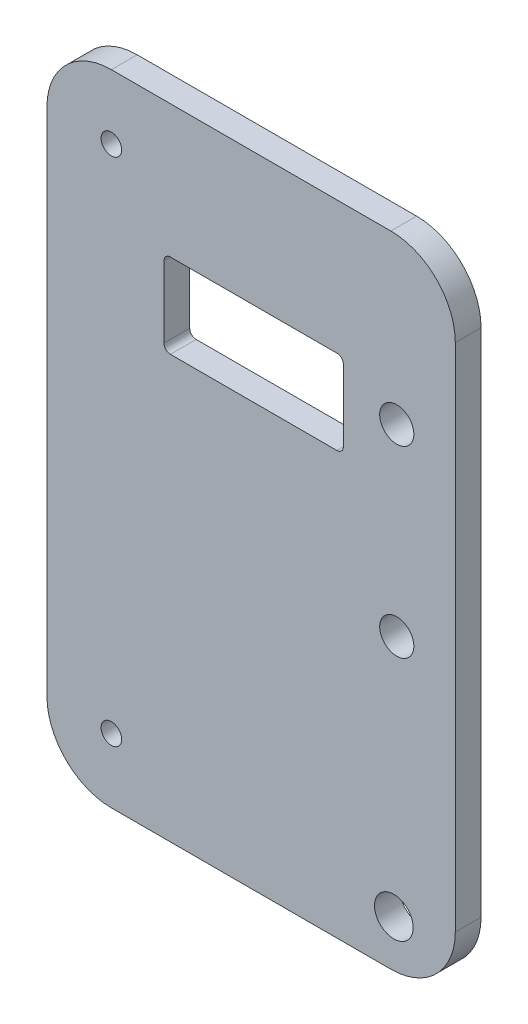
ISO-10303-21;
HEADER;
FILE_DESCRIPTION(('STEP AP214'),'2;1');
FILE_NAME('part.step','',(''),(''),'','','');
FILE_SCHEMA(('AUTOMOTIVE_DESIGN { 1 0 10303 214 1 1 1 1 }'));
ENDSEC;
DATA;
#1=APPLICATION_CONTEXT('core data for automotive mechanical design processes');
#2=APPLICATION_PROTOCOL_DEFINITION('international standard','automotive_design',2000,#1);
#3=PRODUCT_CONTEXT('',#1,'mechanical');
#4=PRODUCT('Part','Part','',(#3));
#5=PRODUCT_RELATED_PRODUCT_CATEGORY('part','',(#4));
#6=PRODUCT_DEFINITION_FORMATION('','',#4);
#7=PRODUCT_DEFINITION_CONTEXT('part definition',#1,'design');
#8=PRODUCT_DEFINITION('design','',#6,#7);
#9=PRODUCT_DEFINITION_SHAPE('','',#8);
#10=(LENGTH_UNIT() NAMED_UNIT(*) SI_UNIT(.MILLI.,.METRE.));
#11=(NAMED_UNIT(*) PLANE_ANGLE_UNIT() SI_UNIT($,.RADIAN.));
#12=(NAMED_UNIT(*) SI_UNIT($,.STERADIAN.) SOLID_ANGLE_UNIT());
#13=UNCERTAINTY_MEASURE_WITH_UNIT(LENGTH_MEASURE(1.E-05),#10,'distance_accuracy_value','');
#14=(GEOMETRIC_REPRESENTATION_CONTEXT(3) GLOBAL_UNCERTAINTY_ASSIGNED_CONTEXT((#13)) GLOBAL_UNIT_ASSIGNED_CONTEXT((#10,
#11,#12)) REPRESENTATION_CONTEXT('',''));
#15=CARTESIAN_POINT('',(0.,0.,0.));
#16=DIRECTION('',(0.,0.,1.));
#17=DIRECTION('',(1.,0.,0.));
#18=AXIS2_PLACEMENT_3D('',#15,#16,#17);
#19=CARTESIAN_POINT('',(0.,0.,4.));
#20=DIRECTION('',(0.,0.,1.));
#21=DIRECTION('',(1.,0.,0.));
#22=AXIS2_PLACEMENT_3D('',#19,#20,#21);
#23=PLANE('',#22);
#24=CARTESIAN_POINT('',(-98.4635783674477,-357.10900904156,4.));
#25=DIRECTION('',(0.,0.,1.));
#26=DIRECTION('',(1.,0.,0.));
#27=AXIS2_PLACEMENT_3D('',#24,#25,#26);
#28=CIRCLE('',#27,1.59999999999999);
#29=CARTESIAN_POINT('',(-96.8635783674477,-357.10900904156,4.));
#30=VERTEX_POINT('',#29);
#31=EDGE_CURVE('E432',#30,#30,#28,.T.);
#32=ORIENTED_EDGE('',*,*,#31,.F.);
#33=EDGE_LOOP('',(#32));
#34=FACE_BOUND('',#33,.T.);
#35=CARTESIAN_POINT('',(-98.4635783674477,-277.869363222234,4.));
#36=DIRECTION('',(0.,0.,1.));
#37=DIRECTION('',(1.,0.,0.));
#38=AXIS2_PLACEMENT_3D('',#35,#36,#37);
#39=CIRCLE('',#38,1.59999999999999);
#40=CARTESIAN_POINT('',(-96.8635783674477,-277.869363222234,4.));
#41=VERTEX_POINT('',#40);
#42=EDGE_CURVE('E434',#41,#41,#39,.T.);
#43=ORIENTED_EDGE('',*,*,#42,.F.);
#44=EDGE_LOOP('',(#43));
#45=FACE_BOUND('',#44,.T.);
#46=CARTESIAN_POINT('',(-54.617319331977,-359.802896905172,4.));
#47=DIRECTION('',(0.,0.,-1.));
#48=DIRECTION('',(-1.,0.,0.));
#49=AXIS2_PLACEMENT_3D('',#46,#47,#48);
#50=CIRCLE('',#49,3.);
#51=CARTESIAN_POINT('',(-57.617319331977,-359.802896905172,4.));
#52=VERTEX_POINT('',#51);
#53=EDGE_CURVE('E445',#52,#52,#50,.T.);
#54=ORIENTED_EDGE('',*,*,#53,.T.);
#55=EDGE_LOOP('',(#54));
#56=FACE_BOUND('',#55,.T.);
#57=CARTESIAN_POINT('',(-54.16270611,-321.91568115646,4.));
#58=DIRECTION('',(0.,0.,1.));
#59=DIRECTION('',(1.,0.,0.));
#60=AXIS2_PLACEMENT_3D('',#57,#58,#59);
#61=CIRCLE('',#60,2.65);
#62=CARTESIAN_POINT('',(-51.51270611,-321.91568115646,4.));
#63=VERTEX_POINT('',#62);
#64=EDGE_CURVE('E448',#63,#63,#61,.T.);
#65=ORIENTED_EDGE('',*,*,#64,.F.);
#66=EDGE_LOOP('',(#65));
#67=FACE_BOUND('',#66,.T.);
#68=CARTESIAN_POINT('',(-54.16270611,-293.415681156461,4.));
#69=DIRECTION('',(0.,0.,1.));
#70=DIRECTION('',(1.,0.,0.));
#71=AXIS2_PLACEMENT_3D('',#68,#69,#70);
#72=CIRCLE('',#71,2.65);
#73=CARTESIAN_POINT('',(-51.51270611,-293.415681156461,4.));
#74=VERTEX_POINT('',#73);
#75=EDGE_CURVE('E454',#74,#74,#72,.T.);
#76=ORIENTED_EDGE('',*,*,#75,.F.);
#77=EDGE_LOOP('',(#76));
#78=FACE_BOUND('',#77,.T.);
#79=DIRECTION('',(-1.,0.,0.));
#80=VECTOR('',#79,1.);
#81=CARTESIAN_POINT('',(-108.463578367448,-267.869363222234,4.));
#82=LINE('',#81,#80);
#83=CARTESIAN_POINT('',(-55.079376553843,-267.869363222234,4.));
#84=VERTEX_POINT('',#83);
#85=CARTESIAN_POINT('',(-98.4635783674477,-267.869363222234,4.));
#86=VERTEX_POINT('',#85);
#87=EDGE_CURVE('E230',#84,#86,#82,.T.);
#88=ORIENTED_EDGE('',*,*,#87,.T.);
#89=CARTESIAN_POINT('',(-98.4635783674477,-277.869363222234,4.));
#90=DIRECTION('',(0.,0.,1.));
#91=DIRECTION('',(1.,0.,0.));
#92=AXIS2_PLACEMENT_3D('',#89,#90,#91);
#93=CIRCLE('',#92,10.);
#94=CARTESIAN_POINT('',(-108.463578367448,-277.869363222234,4.));
#95=VERTEX_POINT('',#94);
#96=EDGE_CURVE('E265',#86,#95,#93,.T.);
#97=ORIENTED_EDGE('',*,*,#96,.T.);
#98=DIRECTION('',(0.,-1.,0.));
#99=VECTOR('',#98,1.);
#100=CARTESIAN_POINT('',(-108.463578367448,-267.869363222234,4.));
#101=LINE('',#100,#99);
#102=CARTESIAN_POINT('',(-108.463578367448,-357.10900904156,4.));
#103=VERTEX_POINT('',#102);
#104=EDGE_CURVE('E222',#95,#103,#101,.T.);
#105=ORIENTED_EDGE('',*,*,#104,.T.);
#106=CARTESIAN_POINT('',(-98.4635783674477,-357.10900904156,4.));
#107=DIRECTION('',(0.,0.,1.));
#108=DIRECTION('',(1.,0.,0.));
#109=AXIS2_PLACEMENT_3D('',#106,#107,#108);
#110=CIRCLE('',#109,10.);
#111=CARTESIAN_POINT('',(-98.4635783674477,-367.10900904156,4.));
#112=VERTEX_POINT('',#111);
#113=EDGE_CURVE('E261',#103,#112,#110,.T.);
#114=ORIENTED_EDGE('',*,*,#113,.T.);
#115=DIRECTION('',(1.,0.,0.));
#116=VECTOR('',#115,1.);
#117=CARTESIAN_POINT('',(-108.463578367448,-367.10900904156,4.));
#118=LINE('',#117,#116);
#119=CARTESIAN_POINT('',(-55.079376553843,-367.10900904156,4.));
#120=VERTEX_POINT('',#119);
#121=EDGE_CURVE('E225',#112,#120,#118,.T.);
#122=ORIENTED_EDGE('',*,*,#121,.T.);
#123=CARTESIAN_POINT('',(-55.079376553843,-357.10900904156,4.));
#124=DIRECTION('',(0.,0.,1.));
#125=DIRECTION('',(1.,0.,0.));
#126=AXIS2_PLACEMENT_3D('',#123,#124,#125);
#127=CIRCLE('',#126,10.);
#128=CARTESIAN_POINT('',(-45.079376553843,-357.10900904156,4.));
#129=VERTEX_POINT('',#128);
#130=EDGE_CURVE('E56',#120,#129,#127,.T.);
#131=ORIENTED_EDGE('',*,*,#130,.T.);
#132=DIRECTION('',(0.,1.,0.));
#133=VECTOR('',#132,1.);
#134=CARTESIAN_POINT('',(-45.079376553843,-267.869363222234,4.));
#135=LINE('',#134,#133);
#136=CARTESIAN_POINT('',(-45.079376553843,-277.869363222234,4.));
#137=VERTEX_POINT('',#136);
#138=EDGE_CURVE('E228',#129,#137,#135,.T.);
#139=ORIENTED_EDGE('',*,*,#138,.T.);
#140=CARTESIAN_POINT('',(-55.079376553843,-277.869363222234,4.));
#141=DIRECTION('',(0.,0.,1.));
#142=DIRECTION('',(1.,0.,0.));
#143=AXIS2_PLACEMENT_3D('',#140,#141,#142);
#144=CIRCLE('',#143,10.);
#145=EDGE_CURVE('E263',#137,#84,#144,.T.);
#146=ORIENTED_EDGE('',*,*,#145,.T.);
#147=EDGE_LOOP('',(#88,#97,#105,#114,#122,#131,#139,#146));
#148=FACE_BOUND('',#147,.T.);
#149=DIRECTION('',(1.,0.,0.));
#150=VECTOR('',#149,1.);
#151=CARTESIAN_POINT('',(-63.4533574609508,-301.557900970713,4.));
#152=LINE('',#151,#150);
#153=CARTESIAN_POINT('',(-89.2971271278972,-301.557900970713,4.));
#154=VERTEX_POINT('',#153);
#155=CARTESIAN_POINT('',(-63.4533574609508,-301.557900970713,4.));
#156=VERTEX_POINT('',#155);
#157=EDGE_CURVE('E160',#154,#156,#152,.T.);
#158=ORIENTED_EDGE('',*,*,#157,.F.);
#159=CARTESIAN_POINT('',(-89.2971271278972,-300.557900970713,4.));
#160=DIRECTION('',(0.,0.,1.));
#161=DIRECTION('',(-1.,0.,0.));
#162=AXIS2_PLACEMENT_3D('',#159,#160,#161);
#163=CIRCLE('',#162,1.);
#164=CARTESIAN_POINT('',(-90.2971271278972,-300.557900970713,4.));
#165=VERTEX_POINT('',#164);
#166=EDGE_CURVE('E150',#165,#154,#163,.T.);
#167=ORIENTED_EDGE('',*,*,#166,.F.);
#168=DIRECTION('',(0.,-1.,0.));
#169=VECTOR('',#168,1.);
#170=CARTESIAN_POINT('',(-90.2971271278972,-300.557900970713,4.));
#171=LINE('',#170,#169);
#172=CARTESIAN_POINT('',(-90.2971271278972,-289.479666406524,4.));
#173=VERTEX_POINT('',#172);
#174=EDGE_CURVE('E187',#173,#165,#171,.T.);
#175=ORIENTED_EDGE('',*,*,#174,.F.);
#176=CARTESIAN_POINT('',(-89.2971271278972,-289.479666406524,4.));
#177=DIRECTION('',(0.,0.,1.));
#178=DIRECTION('',(1.,0.,0.));
#179=AXIS2_PLACEMENT_3D('',#176,#177,#178);
#180=CIRCLE('',#179,1.);
#181=CARTESIAN_POINT('',(-89.2971271278972,-288.479666406524,4.));
#182=VERTEX_POINT('',#181);
#183=EDGE_CURVE('E184',#182,#173,#180,.T.);
#184=ORIENTED_EDGE('',*,*,#183,.F.);
#185=DIRECTION('',(-1.,0.,0.));
#186=VECTOR('',#185,1.);
#187=CARTESIAN_POINT('',(-63.4533574609508,-288.479666406524,4.));
#188=LINE('',#187,#186);
#189=CARTESIAN_POINT('',(-63.4533574609508,-288.479666406524,4.));
#190=VERTEX_POINT('',#189);
#191=EDGE_CURVE('E182',#190,#182,#188,.T.);
#192=ORIENTED_EDGE('',*,*,#191,.F.);
#193=CARTESIAN_POINT('',(-63.4533574609508,-289.479666406524,4.));
#194=DIRECTION('',(0.,0.,1.));
#195=DIRECTION('',(1.,0.,0.));
#196=AXIS2_PLACEMENT_3D('',#193,#194,#195);
#197=CIRCLE('',#196,1.00000000000003);
#198=CARTESIAN_POINT('',(-62.4533574609508,-289.479666406524,4.));
#199=VERTEX_POINT('',#198);
#200=EDGE_CURVE('E180',#199,#190,#197,.T.);
#201=ORIENTED_EDGE('',*,*,#200,.F.);
#202=DIRECTION('',(0.,1.,0.));
#203=VECTOR('',#202,1.);
#204=CARTESIAN_POINT('',(-62.4533574609508,-300.557900970713,4.));
#205=LINE('',#204,#203);
#206=CARTESIAN_POINT('',(-62.4533574609508,-300.557900970713,4.));
#207=VERTEX_POINT('',#206);
#208=EDGE_CURVE('E175',#207,#199,#205,.T.);
#209=ORIENTED_EDGE('',*,*,#208,.F.);
#210=CARTESIAN_POINT('',(-63.4533574609508,-300.557900970713,4.));
#211=DIRECTION('',(0.,0.,1.));
#212=DIRECTION('',(1.,0.,0.));
#213=AXIS2_PLACEMENT_3D('',#210,#211,#212);
#214=CIRCLE('',#213,1.);
#215=EDGE_CURVE('E173',#156,#207,#214,.T.);
#216=ORIENTED_EDGE('',*,*,#215,.F.);
#217=EDGE_LOOP('',(#158,#167,#175,#184,#192,#201,#209,#216));
#218=FACE_BOUND('',#217,.T.);
#219=ADVANCED_FACE('F34',(#34,#45,#56,#67,#78,#148,#218),#23,.T.);
#220=CARTESIAN_POINT('',(0.,0.,0.));
#221=DIRECTION('',(0.,0.,1.));
#222=DIRECTION('',(1.,0.,0.));
#223=AXIS2_PLACEMENT_3D('',#220,#221,#222);
#224=PLANE('',#223);
#225=CARTESIAN_POINT('',(-98.4635783674477,-357.10900904156,0.));
#226=DIRECTION('',(0.,0.,1.));
#227=DIRECTION('',(1.,0.,0.));
#228=AXIS2_PLACEMENT_3D('',#225,#226,#227);
#229=CIRCLE('',#228,1.59999999999999);
#230=CARTESIAN_POINT('',(-96.8635783674477,-357.10900904156,0.));
#231=VERTEX_POINT('',#230);
#232=EDGE_CURVE('E430',#231,#231,#229,.T.);
#233=ORIENTED_EDGE('',*,*,#232,.T.);
#234=EDGE_LOOP('',(#233));
#235=FACE_BOUND('',#234,.T.);
#236=CARTESIAN_POINT('',(-98.4635783674477,-277.869363222234,0.));
#237=DIRECTION('',(0.,0.,1.));
#238=DIRECTION('',(1.,0.,0.));
#239=AXIS2_PLACEMENT_3D('',#236,#237,#238);
#240=CIRCLE('',#239,1.59999999999999);
#241=CARTESIAN_POINT('',(-96.8635783674477,-277.869363222234,0.));
#242=VERTEX_POINT('',#241);
#243=EDGE_CURVE('E439',#242,#242,#240,.T.);
#244=ORIENTED_EDGE('',*,*,#243,.T.);
#245=EDGE_LOOP('',(#244));
#246=FACE_BOUND('',#245,.T.);
#247=CARTESIAN_POINT('',(-54.617319331977,-359.802896905172,0.));
#248=DIRECTION('',(0.,0.,-1.));
#249=DIRECTION('',(-1.,0.,0.));
#250=AXIS2_PLACEMENT_3D('',#247,#248,#249);
#251=CIRCLE('',#250,3.);
#252=CARTESIAN_POINT('',(-57.617319331977,-359.802896905172,0.));
#253=VERTEX_POINT('',#252);
#254=EDGE_CURVE('E442',#253,#253,#251,.T.);
#255=ORIENTED_EDGE('',*,*,#254,.F.);
#256=EDGE_LOOP('',(#255));
#257=FACE_BOUND('',#256,.T.);
#258=CARTESIAN_POINT('',(-54.16270611,-321.91568115646,0.));
#259=DIRECTION('',(0.,0.,1.));
#260=DIRECTION('',(1.,0.,0.));
#261=AXIS2_PLACEMENT_3D('',#258,#259,#260);
#262=CIRCLE('',#261,2.65);
#263=CARTESIAN_POINT('',(-51.51270611,-321.91568115646,0.));
#264=VERTEX_POINT('',#263);
#265=EDGE_CURVE('E451',#264,#264,#262,.T.);
#266=ORIENTED_EDGE('',*,*,#265,.T.);
#267=EDGE_LOOP('',(#266));
#268=FACE_BOUND('',#267,.T.);
#269=CARTESIAN_POINT('',(-54.16270611,-293.415681156461,0.));
#270=DIRECTION('',(0.,0.,1.));
#271=DIRECTION('',(1.,0.,0.));
#272=AXIS2_PLACEMENT_3D('',#269,#270,#271);
#273=CIRCLE('',#272,2.65);
#274=CARTESIAN_POINT('',(-51.51270611,-293.415681156461,0.));
#275=VERTEX_POINT('',#274);
#276=EDGE_CURVE('E191',#275,#275,#273,.T.);
#277=ORIENTED_EDGE('',*,*,#276,.T.);
#278=EDGE_LOOP('',(#277));
#279=FACE_BOUND('',#278,.T.);
#280=DIRECTION('',(0.,-1.,0.));
#281=VECTOR('',#280,1.);
#282=CARTESIAN_POINT('',(-108.463578367448,-267.869363222234,0.));
#283=LINE('',#282,#281);
#284=CARTESIAN_POINT('',(-108.463578367448,-277.869363222234,0.));
#285=VERTEX_POINT('',#284);
#286=CARTESIAN_POINT('',(-108.463578367448,-357.10900904156,0.));
#287=VERTEX_POINT('',#286);
#288=EDGE_CURVE('E168',#285,#287,#283,.T.);
#289=ORIENTED_EDGE('',*,*,#288,.F.);
#290=CARTESIAN_POINT('',(-98.4635783674477,-277.869363222234,0.));
#291=DIRECTION('',(0.,0.,1.));
#292=DIRECTION('',(1.,0.,0.));
#293=AXIS2_PLACEMENT_3D('',#290,#291,#292);
#294=CIRCLE('',#293,10.);
#295=CARTESIAN_POINT('',(-98.4635783674477,-267.869363222234,0.));
#296=VERTEX_POINT('',#295);
#297=EDGE_CURVE('E253',#285,#296,#294,.F.);
#298=ORIENTED_EDGE('',*,*,#297,.T.);
#299=DIRECTION('',(-1.,0.,0.));
#300=VECTOR('',#299,1.);
#301=CARTESIAN_POINT('',(-108.463578367448,-267.869363222234,0.));
#302=LINE('',#301,#300);
#303=CARTESIAN_POINT('',(-55.079376553843,-267.869363222234,0.));
#304=VERTEX_POINT('',#303);
#305=EDGE_CURVE('E226',#304,#296,#302,.T.);
#306=ORIENTED_EDGE('',*,*,#305,.F.);
#307=CARTESIAN_POINT('',(-55.079376553843,-277.869363222234,0.));
#308=DIRECTION('',(0.,0.,1.));
#309=DIRECTION('',(1.,0.,0.));
#310=AXIS2_PLACEMENT_3D('',#307,#308,#309);
#311=CIRCLE('',#310,10.);
#312=CARTESIAN_POINT('',(-45.079376553843,-277.869363222234,0.));
#313=VERTEX_POINT('',#312);
#314=EDGE_CURVE('E251',#304,#313,#311,.F.);
#315=ORIENTED_EDGE('',*,*,#314,.T.);
#316=DIRECTION('',(0.,1.,0.));
#317=VECTOR('',#316,1.);
#318=CARTESIAN_POINT('',(-45.079376553843,-267.869363222234,0.));
#319=LINE('',#318,#317);
#320=CARTESIAN_POINT('',(-45.079376553843,-357.10900904156,0.));
#321=VERTEX_POINT('',#320);
#322=EDGE_CURVE('E239',#321,#313,#319,.T.);
#323=ORIENTED_EDGE('',*,*,#322,.F.);
#324=CARTESIAN_POINT('',(-55.079376553843,-357.10900904156,0.));
#325=DIRECTION('',(0.,0.,1.));
#326=DIRECTION('',(1.,0.,0.));
#327=AXIS2_PLACEMENT_3D('',#324,#325,#326);
#328=CIRCLE('',#327,10.);
#329=CARTESIAN_POINT('',(-55.079376553843,-367.10900904156,0.));
#330=VERTEX_POINT('',#329);
#331=EDGE_CURVE('E247',#321,#330,#328,.F.);
#332=ORIENTED_EDGE('',*,*,#331,.T.);
#333=DIRECTION('',(1.,0.,0.));
#334=VECTOR('',#333,1.);
#335=CARTESIAN_POINT('',(-108.463578367448,-367.10900904156,0.));
#336=LINE('',#335,#334);
#337=CARTESIAN_POINT('',(-98.4635783674477,-367.10900904156,0.));
#338=VERTEX_POINT('',#337);
#339=EDGE_CURVE('E236',#338,#330,#336,.T.);
#340=ORIENTED_EDGE('',*,*,#339,.F.);
#341=CARTESIAN_POINT('',(-98.4635783674477,-357.10900904156,0.));
#342=DIRECTION('',(0.,0.,1.));
#343=DIRECTION('',(1.,0.,0.));
#344=AXIS2_PLACEMENT_3D('',#341,#342,#343);
#345=CIRCLE('',#344,10.);
#346=EDGE_CURVE('E249',#338,#287,#345,.F.);
#347=ORIENTED_EDGE('',*,*,#346,.T.);
#348=EDGE_LOOP('',(#289,#298,#306,#315,#323,#332,#340,#347));
#349=FACE_BOUND('',#348,.T.);
#350=CARTESIAN_POINT('',(-89.2971271278972,-300.557900970713,0.));
#351=DIRECTION('',(0.,0.,1.));
#352=DIRECTION('',(-1.,0.,0.));
#353=AXIS2_PLACEMENT_3D('',#350,#351,#352);
#354=CIRCLE('',#353,1.);
#355=CARTESIAN_POINT('',(-90.2971271278972,-300.557900970713,0.));
#356=VERTEX_POINT('',#355);
#357=CARTESIAN_POINT('',(-89.2971271278972,-301.557900970713,0.));
#358=VERTEX_POINT('',#357);
#359=EDGE_CURVE('E189',#356,#358,#354,.T.);
#360=ORIENTED_EDGE('',*,*,#359,.T.);
#361=DIRECTION('',(1.,0.,0.));
#362=VECTOR('',#361,1.);
#363=CARTESIAN_POINT('',(-63.4533574609508,-301.557900970713,0.));
#364=LINE('',#363,#362);
#365=CARTESIAN_POINT('',(-63.4533574609508,-301.557900970713,0.));
#366=VERTEX_POINT('',#365);
#367=EDGE_CURVE('E167',#358,#366,#364,.T.);
#368=ORIENTED_EDGE('',*,*,#367,.T.);
#369=CARTESIAN_POINT('',(-63.4533574609508,-300.557900970713,0.));
#370=DIRECTION('',(0.,0.,1.));
#371=DIRECTION('',(1.,0.,0.));
#372=AXIS2_PLACEMENT_3D('',#369,#370,#371);
#373=CIRCLE('',#372,1.);
#374=CARTESIAN_POINT('',(-62.4533574609508,-300.557900970713,0.));
#375=VERTEX_POINT('',#374);
#376=EDGE_CURVE('E193',#366,#375,#373,.T.);
#377=ORIENTED_EDGE('',*,*,#376,.T.);
#378=DIRECTION('',(0.,1.,0.));
#379=VECTOR('',#378,1.);
#380=CARTESIAN_POINT('',(-62.4533574609508,-300.557900970713,0.));
#381=LINE('',#380,#379);
#382=CARTESIAN_POINT('',(-62.4533574609508,-289.479666406524,0.));
#383=VERTEX_POINT('',#382);
#384=EDGE_CURVE('E196',#375,#383,#381,.T.);
#385=ORIENTED_EDGE('',*,*,#384,.T.);
#386=CARTESIAN_POINT('',(-63.4533574609508,-289.479666406524,0.));
#387=DIRECTION('',(0.,0.,1.));
#388=DIRECTION('',(1.,0.,0.));
#389=AXIS2_PLACEMENT_3D('',#386,#387,#388);
#390=CIRCLE('',#389,1.00000000000003);
#391=CARTESIAN_POINT('',(-63.4533574609508,-288.479666406524,0.));
#392=VERTEX_POINT('',#391);
#393=EDGE_CURVE('E199',#383,#392,#390,.T.);
#394=ORIENTED_EDGE('',*,*,#393,.T.);
#395=DIRECTION('',(-1.,0.,0.));
#396=VECTOR('',#395,1.);
#397=CARTESIAN_POINT('',(-63.4533574609508,-288.479666406524,0.));
#398=LINE('',#397,#396);
#399=CARTESIAN_POINT('',(-89.2971271278972,-288.479666406524,0.));
#400=VERTEX_POINT('',#399);
#401=EDGE_CURVE('E202',#392,#400,#398,.T.);
#402=ORIENTED_EDGE('',*,*,#401,.T.);
#403=CARTESIAN_POINT('',(-89.2971271278972,-289.479666406524,0.));
#404=DIRECTION('',(0.,0.,1.));
#405=DIRECTION('',(1.,0.,0.));
#406=AXIS2_PLACEMENT_3D('',#403,#404,#405);
#407=CIRCLE('',#406,1.);
#408=CARTESIAN_POINT('',(-90.2971271278972,-289.479666406524,0.));
#409=VERTEX_POINT('',#408);
#410=EDGE_CURVE('E205',#400,#409,#407,.T.);
#411=ORIENTED_EDGE('',*,*,#410,.T.);
#412=DIRECTION('',(0.,-1.,0.));
#413=VECTOR('',#412,1.);
#414=CARTESIAN_POINT('',(-90.2971271278972,-300.557900970713,0.));
#415=LINE('',#414,#413);
#416=EDGE_CURVE('E161',#409,#356,#415,.T.);
#417=ORIENTED_EDGE('',*,*,#416,.T.);
#418=EDGE_LOOP('',(#360,#368,#377,#385,#394,#402,#411,#417));
#419=FACE_BOUND('',#418,.T.);
#420=ADVANCED_FACE('F283',(#235,#246,#257,#268,#279,#349,#419),#224,.F.);
#421=CARTESIAN_POINT('',(-108.463578367448,-267.869363222234,4.));
#422=DIRECTION('',(1.,0.,0.));
#423=DIRECTION('',(0.,0.,-1.));
#424=AXIS2_PLACEMENT_3D('',#421,#422,#423);
#425=PLANE('',#424);
#426=ORIENTED_EDGE('',*,*,#104,.F.);
#427=DIRECTION('',(0.,0.,-1.));
#428=VECTOR('',#427,1.);
#429=CARTESIAN_POINT('',(-108.463578367448,-277.869363222234,4.));
#430=LINE('',#429,#428);
#431=EDGE_CURVE('E244',#95,#285,#430,.T.);
#432=ORIENTED_EDGE('',*,*,#431,.T.);
#433=ORIENTED_EDGE('',*,*,#288,.T.);
#434=DIRECTION('',(0.,0.,-1.));
#435=VECTOR('',#434,1.);
#436=CARTESIAN_POINT('',(-108.463578367448,-357.10900904156,4.));
#437=LINE('',#436,#435);
#438=EDGE_CURVE('E233',#287,#103,#437,.F.);
#439=ORIENTED_EDGE('',*,*,#438,.T.);
#440=EDGE_LOOP('',(#426,#432,#433,#439));
#441=FACE_BOUND('',#440,.T.);
#442=ADVANCED_FACE('F300',(#441),#425,.F.);
#443=CARTESIAN_POINT('',(-108.463578367448,-367.10900904156,4.));
#444=DIRECTION('',(0.,1.,0.));
#445=DIRECTION('',(0.,0.,1.));
#446=AXIS2_PLACEMENT_3D('',#443,#444,#445);
#447=PLANE('',#446);
#448=ORIENTED_EDGE('',*,*,#121,.F.);
#449=DIRECTION('',(0.,0.,-1.));
#450=VECTOR('',#449,1.);
#451=CARTESIAN_POINT('',(-98.4635783674477,-367.10900904156,4.));
#452=LINE('',#451,#450);
#453=EDGE_CURVE('E11',#112,#338,#452,.T.);
#454=ORIENTED_EDGE('',*,*,#453,.T.);
#455=ORIENTED_EDGE('',*,*,#339,.T.);
#456=DIRECTION('',(0.,0.,-1.));
#457=VECTOR('',#456,1.);
#458=CARTESIAN_POINT('',(-55.079376553843,-367.10900904156,4.));
#459=LINE('',#458,#457);
#460=EDGE_CURVE('E42',#330,#120,#459,.F.);
#461=ORIENTED_EDGE('',*,*,#460,.T.);
#462=EDGE_LOOP('',(#448,#454,#455,#461));
#463=FACE_BOUND('',#462,.T.);
#464=ADVANCED_FACE('F273',(#463),#447,.F.);
#465=CARTESIAN_POINT('',(-45.079376553843,-267.869363222234,4.));
#466=DIRECTION('',(-1.,0.,0.));
#467=DIRECTION('',(0.,0.,1.));
#468=AXIS2_PLACEMENT_3D('',#465,#466,#467);
#469=PLANE('',#468);
#470=ORIENTED_EDGE('',*,*,#322,.T.);
#471=DIRECTION('',(0.,0.,-1.));
#472=VECTOR('',#471,1.);
#473=CARTESIAN_POINT('',(-45.079376553843,-277.869363222234,4.));
#474=LINE('',#473,#472);
#475=EDGE_CURVE('E49',#313,#137,#474,.F.);
#476=ORIENTED_EDGE('',*,*,#475,.T.);
#477=ORIENTED_EDGE('',*,*,#138,.F.);
#478=DIRECTION('',(0.,0.,-1.));
#479=VECTOR('',#478,1.);
#480=CARTESIAN_POINT('',(-45.079376553843,-357.10900904156,4.));
#481=LINE('',#480,#479);
#482=EDGE_CURVE('E267',#129,#321,#481,.T.);
#483=ORIENTED_EDGE('',*,*,#482,.T.);
#484=EDGE_LOOP('',(#470,#476,#477,#483));
#485=FACE_BOUND('',#484,.T.);
#486=ADVANCED_FACE('F280',(#485),#469,.F.);
#487=CARTESIAN_POINT('',(-108.463578367448,-267.869363222234,4.));
#488=DIRECTION('',(0.,-1.,0.));
#489=DIRECTION('',(0.,0.,-1.));
#490=AXIS2_PLACEMENT_3D('',#487,#488,#489);
#491=PLANE('',#490);
#492=ORIENTED_EDGE('',*,*,#305,.T.);
#493=DIRECTION('',(0.,0.,-1.));
#494=VECTOR('',#493,1.);
#495=CARTESIAN_POINT('',(-98.4635783674477,-267.869363222234,4.));
#496=LINE('',#495,#494);
#497=EDGE_CURVE('E258',#296,#86,#496,.F.);
#498=ORIENTED_EDGE('',*,*,#497,.T.);
#499=ORIENTED_EDGE('',*,*,#87,.F.);
#500=DIRECTION('',(0.,0.,-1.));
#501=VECTOR('',#500,1.);
#502=CARTESIAN_POINT('',(-55.079376553843,-267.869363222234,4.));
#503=LINE('',#502,#501);
#504=EDGE_CURVE('E255',#84,#304,#503,.T.);
#505=ORIENTED_EDGE('',*,*,#504,.T.);
#506=EDGE_LOOP('',(#492,#498,#499,#505));
#507=FACE_BOUND('',#506,.T.);
#508=ADVANCED_FACE('F292',(#507),#491,.F.);
#509=CARTESIAN_POINT('',(-89.2971271278972,-300.557900970713,4.));
#510=DIRECTION('',(0.,0.,-1.));
#511=DIRECTION('',(-1.,0.,0.));
#512=AXIS2_PLACEMENT_3D('',#509,#510,#511);
#513=CYLINDRICAL_SURFACE('',#512,1.);
#514=ORIENTED_EDGE('',*,*,#359,.F.);
#515=DIRECTION('',(0.,0.,-1.));
#516=VECTOR('',#515,1.);
#517=CARTESIAN_POINT('',(-90.2971271278972,-300.557900970713,4.));
#518=LINE('',#517,#516);
#519=EDGE_CURVE('E156',#165,#356,#518,.T.);
#520=ORIENTED_EDGE('',*,*,#519,.F.);
#521=ORIENTED_EDGE('',*,*,#166,.T.);
#522=DIRECTION('',(0.,0.,-1.));
#523=VECTOR('',#522,1.);
#524=CARTESIAN_POINT('',(-89.2971271278972,-301.557900970713,4.));
#525=LINE('',#524,#523);
#526=EDGE_CURVE('E153',#154,#358,#525,.T.);
#527=ORIENTED_EDGE('',*,*,#526,.T.);
#528=EDGE_LOOP('',(#514,#520,#521,#527));
#529=FACE_BOUND('',#528,.T.);
#530=ADVANCED_FACE('F152',(#529),#513,.F.);
#531=CARTESIAN_POINT('',(-63.4533574609508,-301.557900970713,4.));
#532=DIRECTION('',(0.,1.,0.));
#533=DIRECTION('',(0.,0.,1.));
#534=AXIS2_PLACEMENT_3D('',#531,#532,#533);
#535=PLANE('',#534);
#536=ORIENTED_EDGE('',*,*,#367,.F.);
#537=ORIENTED_EDGE('',*,*,#526,.F.);
#538=ORIENTED_EDGE('',*,*,#157,.T.);
#539=DIRECTION('',(0.,0.,-1.));
#540=VECTOR('',#539,1.);
#541=CARTESIAN_POINT('',(-63.4533574609508,-301.557900970713,4.));
#542=LINE('',#541,#540);
#543=EDGE_CURVE('E169',#156,#366,#542,.T.);
#544=ORIENTED_EDGE('',*,*,#543,.T.);
#545=EDGE_LOOP('',(#536,#537,#538,#544));
#546=FACE_BOUND('',#545,.T.);
#547=ADVANCED_FACE('F164',(#546),#535,.T.);
#548=CARTESIAN_POINT('',(-63.4533574609508,-300.557900970713,4.));
#549=DIRECTION('',(0.,0.,-1.));
#550=DIRECTION('',(-1.,0.,0.));
#551=AXIS2_PLACEMENT_3D('',#548,#549,#550);
#552=CYLINDRICAL_SURFACE('',#551,1.);
#553=ORIENTED_EDGE('',*,*,#376,.F.);
#554=ORIENTED_EDGE('',*,*,#543,.F.);
#555=ORIENTED_EDGE('',*,*,#215,.T.);
#556=DIRECTION('',(0.,0.,-1.));
#557=VECTOR('',#556,1.);
#558=CARTESIAN_POINT('',(-62.4533574609508,-300.557900970713,4.));
#559=LINE('',#558,#557);
#560=EDGE_CURVE('E219',#207,#375,#559,.T.);
#561=ORIENTED_EDGE('',*,*,#560,.T.);
#562=EDGE_LOOP('',(#553,#554,#555,#561));
#563=FACE_BOUND('',#562,.T.);
#564=ADVANCED_FACE('F369',(#563),#552,.F.);
#565=CARTESIAN_POINT('',(-62.4533574609508,-300.557900970713,4.));
#566=DIRECTION('',(-1.,0.,0.));
#567=DIRECTION('',(0.,0.,1.));
#568=AXIS2_PLACEMENT_3D('',#565,#566,#567);
#569=PLANE('',#568);
#570=ORIENTED_EDGE('',*,*,#384,.F.);
#571=ORIENTED_EDGE('',*,*,#560,.F.);
#572=ORIENTED_EDGE('',*,*,#208,.T.);
#573=DIRECTION('',(0.,0.,-1.));
#574=VECTOR('',#573,1.);
#575=CARTESIAN_POINT('',(-62.4533574609508,-289.479666406524,4.));
#576=LINE('',#575,#574);
#577=EDGE_CURVE('E217',#199,#383,#576,.T.);
#578=ORIENTED_EDGE('',*,*,#577,.T.);
#579=EDGE_LOOP('',(#570,#571,#572,#578));
#580=FACE_BOUND('',#579,.T.);
#581=ADVANCED_FACE('F365',(#580),#569,.T.);
#582=CARTESIAN_POINT('',(-63.4533574609508,-289.479666406524,4.));
#583=DIRECTION('',(0.,0.,-1.));
#584=DIRECTION('',(-1.,0.,0.));
#585=AXIS2_PLACEMENT_3D('',#582,#583,#584);
#586=CYLINDRICAL_SURFACE('',#585,1.00000000000003);
#587=ORIENTED_EDGE('',*,*,#393,.F.);
#588=ORIENTED_EDGE('',*,*,#577,.F.);
#589=ORIENTED_EDGE('',*,*,#200,.T.);
#590=DIRECTION('',(0.,0.,-1.));
#591=VECTOR('',#590,1.);
#592=CARTESIAN_POINT('',(-63.4533574609508,-288.479666406524,4.));
#593=LINE('',#592,#591);
#594=EDGE_CURVE('E215',#190,#392,#593,.T.);
#595=ORIENTED_EDGE('',*,*,#594,.T.);
#596=EDGE_LOOP('',(#587,#588,#589,#595));
#597=FACE_BOUND('',#596,.T.);
#598=ADVANCED_FACE('F361',(#597),#586,.F.);
#599=CARTESIAN_POINT('',(-63.4533574609508,-288.479666406524,4.));
#600=DIRECTION('',(0.,-1.,0.));
#601=DIRECTION('',(0.,0.,-1.));
#602=AXIS2_PLACEMENT_3D('',#599,#600,#601);
#603=PLANE('',#602);
#604=ORIENTED_EDGE('',*,*,#401,.F.);
#605=ORIENTED_EDGE('',*,*,#594,.F.);
#606=ORIENTED_EDGE('',*,*,#191,.T.);
#607=DIRECTION('',(0.,0.,-1.));
#608=VECTOR('',#607,1.);
#609=CARTESIAN_POINT('',(-89.2971271278972,-288.479666406524,4.));
#610=LINE('',#609,#608);
#611=EDGE_CURVE('E213',#182,#400,#610,.T.);
#612=ORIENTED_EDGE('',*,*,#611,.T.);
#613=EDGE_LOOP('',(#604,#605,#606,#612));
#614=FACE_BOUND('',#613,.T.);
#615=ADVANCED_FACE('F357',(#614),#603,.T.);
#616=CARTESIAN_POINT('',(-89.2971271278972,-289.479666406524,4.));
#617=DIRECTION('',(0.,0.,-1.));
#618=DIRECTION('',(-1.,0.,0.));
#619=AXIS2_PLACEMENT_3D('',#616,#617,#618);
#620=CYLINDRICAL_SURFACE('',#619,1.);
#621=ORIENTED_EDGE('',*,*,#410,.F.);
#622=ORIENTED_EDGE('',*,*,#611,.F.);
#623=ORIENTED_EDGE('',*,*,#183,.T.);
#624=DIRECTION('',(0.,0.,-1.));
#625=VECTOR('',#624,1.);
#626=CARTESIAN_POINT('',(-90.2971271278972,-289.479666406524,4.));
#627=LINE('',#626,#625);
#628=EDGE_CURVE('E211',#173,#409,#627,.T.);
#629=ORIENTED_EDGE('',*,*,#628,.T.);
#630=EDGE_LOOP('',(#621,#622,#623,#629));
#631=FACE_BOUND('',#630,.T.);
#632=ADVANCED_FACE('F353',(#631),#620,.F.);
#633=CARTESIAN_POINT('',(-90.2971271278972,-300.557900970713,4.));
#634=DIRECTION('',(1.,0.,0.));
#635=DIRECTION('',(0.,0.,-1.));
#636=AXIS2_PLACEMENT_3D('',#633,#634,#635);
#637=PLANE('',#636);
#638=ORIENTED_EDGE('',*,*,#416,.F.);
#639=ORIENTED_EDGE('',*,*,#628,.F.);
#640=ORIENTED_EDGE('',*,*,#174,.T.);
#641=ORIENTED_EDGE('',*,*,#519,.T.);
#642=EDGE_LOOP('',(#638,#639,#640,#641));
#643=FACE_BOUND('',#642,.T.);
#644=ADVANCED_FACE('F343',(#643),#637,.T.);
#645=CARTESIAN_POINT('',(-54.16270611,-293.415681156461,4.));
#646=DIRECTION('',(0.,0.,1.));
#647=DIRECTION('',(1.,0.,0.));
#648=AXIS2_PLACEMENT_3D('',#645,#646,#647);
#649=CYLINDRICAL_SURFACE('',#648,2.65);
#650=ORIENTED_EDGE('',*,*,#276,.F.);
#651=EDGE_LOOP('',(#650));
#652=FACE_BOUND('',#651,.T.);
#653=ORIENTED_EDGE('',*,*,#75,.T.);
#654=EDGE_LOOP('',(#653));
#655=FACE_BOUND('',#654,.T.);
#656=ADVANCED_FACE('F337',(#652,#655),#649,.F.);
#657=CARTESIAN_POINT('',(-54.16270611,-321.91568115646,4.));
#658=DIRECTION('',(0.,0.,1.));
#659=DIRECTION('',(1.,0.,0.));
#660=AXIS2_PLACEMENT_3D('',#657,#658,#659);
#661=CYLINDRICAL_SURFACE('',#660,2.65);
#662=ORIENTED_EDGE('',*,*,#265,.F.);
#663=EDGE_LOOP('',(#662));
#664=FACE_BOUND('',#663,.T.);
#665=ORIENTED_EDGE('',*,*,#64,.T.);
#666=EDGE_LOOP('',(#665));
#667=FACE_BOUND('',#666,.T.);
#668=ADVANCED_FACE('F333',(#664,#667),#661,.F.);
#669=CARTESIAN_POINT('',(-98.4635783674477,-277.869363222234,4.));
#670=DIRECTION('',(0.,0.,-1.));
#671=DIRECTION('',(-1.,0.,0.));
#672=AXIS2_PLACEMENT_3D('',#669,#670,#671);
#673=CYLINDRICAL_SURFACE('',#672,10.);
#674=ORIENTED_EDGE('',*,*,#96,.F.);
#675=ORIENTED_EDGE('',*,*,#497,.F.);
#676=ORIENTED_EDGE('',*,*,#297,.F.);
#677=ORIENTED_EDGE('',*,*,#431,.F.);
#678=EDGE_LOOP('',(#674,#675,#676,#677));
#679=FACE_BOUND('',#678,.T.);
#680=ADVANCED_FACE('F298',(#679),#673,.T.);
#681=CARTESIAN_POINT('',(-55.079376553843,-277.869363222234,4.));
#682=DIRECTION('',(0.,0.,-1.));
#683=DIRECTION('',(-1.,0.,0.));
#684=AXIS2_PLACEMENT_3D('',#681,#682,#683);
#685=CYLINDRICAL_SURFACE('',#684,10.);
#686=ORIENTED_EDGE('',*,*,#145,.F.);
#687=ORIENTED_EDGE('',*,*,#475,.F.);
#688=ORIENTED_EDGE('',*,*,#314,.F.);
#689=ORIENTED_EDGE('',*,*,#504,.F.);
#690=EDGE_LOOP('',(#686,#687,#688,#689));
#691=FACE_BOUND('',#690,.T.);
#692=ADVANCED_FACE('F289',(#691),#685,.T.);
#693=CARTESIAN_POINT('',(-98.4635783674477,-357.10900904156,4.));
#694=DIRECTION('',(0.,0.,-1.));
#695=DIRECTION('',(-1.,0.,0.));
#696=AXIS2_PLACEMENT_3D('',#693,#694,#695);
#697=CYLINDRICAL_SURFACE('',#696,10.);
#698=ORIENTED_EDGE('',*,*,#113,.F.);
#699=ORIENTED_EDGE('',*,*,#438,.F.);
#700=ORIENTED_EDGE('',*,*,#346,.F.);
#701=ORIENTED_EDGE('',*,*,#453,.F.);
#702=EDGE_LOOP('',(#698,#699,#700,#701));
#703=FACE_BOUND('',#702,.T.);
#704=ADVANCED_FACE('F303',(#703),#697,.T.);
#705=CARTESIAN_POINT('',(-55.079376553843,-357.10900904156,4.));
#706=DIRECTION('',(0.,0.,-1.));
#707=DIRECTION('',(-1.,0.,0.));
#708=AXIS2_PLACEMENT_3D('',#705,#706,#707);
#709=CYLINDRICAL_SURFACE('',#708,10.);
#710=ORIENTED_EDGE('',*,*,#130,.F.);
#711=ORIENTED_EDGE('',*,*,#460,.F.);
#712=ORIENTED_EDGE('',*,*,#331,.F.);
#713=ORIENTED_EDGE('',*,*,#482,.F.);
#714=EDGE_LOOP('',(#710,#711,#712,#713));
#715=FACE_BOUND('',#714,.T.);
#716=ADVANCED_FACE('F36',(#715),#709,.T.);
#717=CARTESIAN_POINT('',(-54.617319331977,-359.802896905172,0.));
#718=DIRECTION('',(0.,0.,-1.));
#719=DIRECTION('',(-1.,0.,0.));
#720=AXIS2_PLACEMENT_3D('',#717,#718,#719);
#721=CYLINDRICAL_SURFACE('',#720,3.);
#722=ORIENTED_EDGE('',*,*,#53,.F.);
#723=EDGE_LOOP('',(#722));
#724=FACE_BOUND('',#723,.T.);
#725=ORIENTED_EDGE('',*,*,#254,.T.);
#726=EDGE_LOOP('',(#725));
#727=FACE_BOUND('',#726,.T.);
#728=ADVANCED_FACE('F309',(#724,#727),#721,.F.);
#729=CARTESIAN_POINT('',(-98.4635783674477,-277.869363222234,4.));
#730=DIRECTION('',(0.,0.,1.));
#731=DIRECTION('',(1.,0.,0.));
#732=AXIS2_PLACEMENT_3D('',#729,#730,#731);
#733=CYLINDRICAL_SURFACE('',#732,1.59999999999999);
#734=ORIENTED_EDGE('',*,*,#243,.F.);
#735=EDGE_LOOP('',(#734));
#736=FACE_BOUND('',#735,.T.);
#737=ORIENTED_EDGE('',*,*,#42,.T.);
#738=EDGE_LOOP('',(#737));
#739=FACE_BOUND('',#738,.T.);
#740=ADVANCED_FACE('F407',(#736,#739),#733,.F.);
#741=CARTESIAN_POINT('',(-98.4635783674477,-357.10900904156,4.));
#742=DIRECTION('',(0.,0.,1.));
#743=DIRECTION('',(1.,0.,0.));
#744=AXIS2_PLACEMENT_3D('',#741,#742,#743);
#745=CYLINDRICAL_SURFACE('',#744,1.59999999999999);
#746=ORIENTED_EDGE('',*,*,#232,.F.);
#747=EDGE_LOOP('',(#746));
#748=FACE_BOUND('',#747,.T.);
#749=ORIENTED_EDGE('',*,*,#31,.T.);
#750=EDGE_LOOP('',(#749));
#751=FACE_BOUND('',#750,.T.);
#752=ADVANCED_FACE('F412',(#748,#751),#745,.F.);
#753=CLOSED_SHELL('',(#219,#420,#442,#464,#486,#508,#530,#547,#564,#581,#598,#615,#632,#644,
#656,#668,#680,#692,#704,#716,#728,#740,#752));
#754=MANIFOLD_SOLID_BREP('B2',#753);
#755=ADVANCED_BREP_SHAPE_REPRESENTATION('',(#18,#754),#14);
#756=SHAPE_DEFINITION_REPRESENTATION(#9,#755);
ENDSEC;
END-ISO-10303-21;
